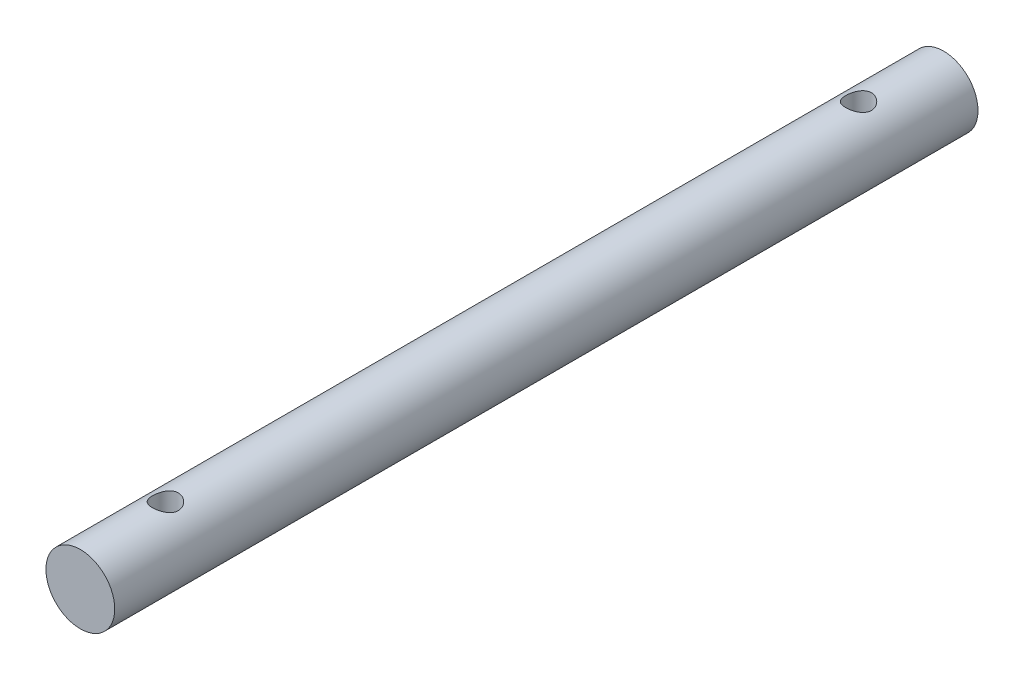
ISO-10303-21;
HEADER;
FILE_DESCRIPTION(('STEP AP214'),'2;1');
FILE_NAME('part.step','',(''),(''),'','','');
FILE_SCHEMA(('AUTOMOTIVE_DESIGN { 1 0 10303 214 1 1 1 1 }'));
ENDSEC;
DATA;
#1=APPLICATION_CONTEXT('core data for automotive mechanical design processes');
#2=APPLICATION_PROTOCOL_DEFINITION('international standard','automotive_design',2000,#1);
#3=PRODUCT_CONTEXT('',#1,'mechanical');
#4=PRODUCT('Part','Part','',(#3));
#5=PRODUCT_RELATED_PRODUCT_CATEGORY('part','',(#4));
#6=PRODUCT_DEFINITION_FORMATION('','',#4);
#7=PRODUCT_DEFINITION_CONTEXT('part definition',#1,'design');
#8=PRODUCT_DEFINITION('design','',#6,#7);
#9=PRODUCT_DEFINITION_SHAPE('','',#8);
#10=(LENGTH_UNIT() NAMED_UNIT(*) SI_UNIT(.MILLI.,.METRE.));
#11=(NAMED_UNIT(*) PLANE_ANGLE_UNIT() SI_UNIT($,.RADIAN.));
#12=(NAMED_UNIT(*) SI_UNIT($,.STERADIAN.) SOLID_ANGLE_UNIT());
#13=UNCERTAINTY_MEASURE_WITH_UNIT(LENGTH_MEASURE(1.E-05),#10,'distance_accuracy_value','');
#14=(GEOMETRIC_REPRESENTATION_CONTEXT(3) GLOBAL_UNCERTAINTY_ASSIGNED_CONTEXT((#13)) GLOBAL_UNIT_ASSIGNED_CONTEXT((#10,
#11,#12)) REPRESENTATION_CONTEXT('',''));
#15=CARTESIAN_POINT('',(0.,0.,0.));
#16=DIRECTION('',(0.,0.,1.));
#17=DIRECTION('',(1.,0.,0.));
#18=AXIS2_PLACEMENT_3D('',#15,#16,#17);
#19=CARTESIAN_POINT('',(0.,0.,50.18));
#20=DIRECTION('',(0.,0.,-1.));
#21=DIRECTION('',(-1.,0.,0.));
#22=AXIS2_PLACEMENT_3D('',#19,#20,#21);
#23=CYLINDRICAL_SURFACE('',#22,4.);
#24=CARTESIAN_POINT('',(0.,-4.,-38.79));
#25=CARTESIAN_POINT('',(0.0812350589378528,-4.00000217456151,-38.7899970976969));
#26=CARTESIAN_POINT('',(0.162450241781792,-3.99750379283184,-38.7966197602484));
#27=CARTESIAN_POINT('',(0.322453452352361,-3.98778696006928,-38.8228281952699));
#28=CARTESIAN_POINT('',(0.401241827987616,-3.98056918893993,-38.8424121004706));
#29=CARTESIAN_POINT('',(0.554060784990878,-3.96218832391545,-38.8937530017718));
#30=CARTESIAN_POINT('',(0.628100224162276,-3.9510328434944,-38.9254865168218));
#31=CARTESIAN_POINT('',(0.769799310160253,-3.92588767765353,-39.0001064130158));
#32=CARTESIAN_POINT('',(0.837457239177879,-3.91189723227548,-39.0429957855442));
#33=CARTESIAN_POINT('',(0.967346417045828,-3.88186246971217,-39.1406125310709));
#34=CARTESIAN_POINT('',(1.0292707301512,-3.86576002583566,-39.1957302622594));
#35=CARTESIAN_POINT('',(1.14324421474363,-3.83360220871327,-39.3154104346588));
#36=CARTESIAN_POINT('',(1.19529036359203,-3.81754685135033,-39.3799757560879));
#37=CARTESIAN_POINT('',(1.28998202215985,-3.78662470617731,-39.5197174675232));
#38=CARTESIAN_POINT('',(1.3321939319576,-3.77182648820818,-39.5952043665458));
#39=CARTESIAN_POINT('',(1.40318646334084,-3.74599860237433,-39.7528483541685));
#40=CARTESIAN_POINT('',(1.43197244961239,-3.73496742975881,-39.8350027631551));
#41=CARTESIAN_POINT('',(1.47408431017549,-3.71854412824136,-40.0001167402582));
#42=CARTESIAN_POINT('',(1.48799593218558,-3.71293924350838,-40.0829050384354));
#43=CARTESIAN_POINT('',(1.50179556531648,-3.70738061461215,-40.2498161579938));
#44=CARTESIAN_POINT('',(1.50168936802631,-3.70742453659305,-40.3339384138745));
#45=CARTESIAN_POINT('',(1.48790429610018,-3.71297511632055,-40.495769525213));
#46=CARTESIAN_POINT('',(1.47503808509004,-3.71815468871122,-40.5735609060442));
#47=CARTESIAN_POINT('',(1.4374416786833,-3.73284938059529,-40.7257871504053));
#48=CARTESIAN_POINT('',(1.41270969663258,-3.74236515298863,-40.8002215066139));
#49=CARTESIAN_POINT('',(1.35163748571904,-3.76485702190253,-40.9452770677282));
#50=CARTESIAN_POINT('',(1.31508648737101,-3.77789517988166,-41.0157994861213));
#51=CARTESIAN_POINT('',(1.23156073762698,-3.80594210139319,-41.149945737591));
#52=CARTESIAN_POINT('',(1.18458238728897,-3.82095154457158,-41.2135671775197));
#53=CARTESIAN_POINT('',(1.07781780766549,-3.85248038859113,-41.3366036636509));
#54=CARTESIAN_POINT('',(1.01738298716955,-3.86903347455671,-41.3954486407481));
#55=CARTESIAN_POINT('',(0.887312590819017,-3.90091728164086,-41.5023379662058));
#56=CARTESIAN_POINT('',(0.81767560349736,-3.91624781465952,-41.5503806546057));
#57=CARTESIAN_POINT('',(0.669723436992414,-3.9442639480908,-41.6349303970625));
#58=CARTESIAN_POINT('',(0.591290713844713,-3.95690498259616,-41.6712475812211));
#59=CARTESIAN_POINT('',(0.428836850524578,-3.97778718326962,-41.72998260427));
#60=CARTESIAN_POINT('',(0.344818210845764,-3.98603030341493,-41.7524066165611));
#61=CARTESIAN_POINT('',(0.178375243148663,-3.99684443228065,-41.7816227875419));
#62=CARTESIAN_POINT('',(0.0961036195622074,-3.99969369025686,-41.7891826063825));
#63=CARTESIAN_POINT('',(-0.068572475255026,-4.00025893700126,-41.7906910638999));
#64=CARTESIAN_POINT('',(-0.150976912983374,-3.99797606386863,-41.7846427203168));
#65=CARTESIAN_POINT('',(-0.31026204856186,-3.98871709772643,-41.7596899576913));
#66=CARTESIAN_POINT('',(-0.387233328007337,-3.98192470962305,-41.7412884562629));
#67=CARTESIAN_POINT('',(-0.536941754957222,-3.96451477091717,-41.6928139274527));
#68=CARTESIAN_POINT('',(-0.609678350347535,-3.9538967228203,-41.662739382052));
#69=CARTESIAN_POINT('',(-0.751247765110156,-3.92949624407681,-41.5908135875605));
#70=CARTESIAN_POINT('',(-0.819903083557796,-3.91563000209348,-41.5486422707766));
#71=CARTESIAN_POINT('',(-0.949392711726626,-3.88626671564664,-41.4540818968284));
#72=CARTESIAN_POINT('',(-1.01022412027045,-3.87076907009516,-41.4016890674548));
#73=CARTESIAN_POINT('',(-1.12603079874454,-3.8387332949099,-41.2845958778757));
#74=CARTESIAN_POINT('',(-1.18046154123568,-3.82218696503729,-41.2193578172273));
#75=CARTESIAN_POINT('',(-1.27771050031903,-3.79078815746854,-41.0803486152923));
#76=CARTESIAN_POINT('',(-1.32052767414518,-3.77593583194399,-41.0065767086115));
#77=CARTESIAN_POINT('',(-1.39337773518998,-3.74966829822463,-40.8519840132277));
#78=CARTESIAN_POINT('',(-1.42335685446918,-3.73826760328493,-40.7711352540896));
#79=CARTESIAN_POINT('',(-1.46907883466889,-3.72054032891005,-40.6049902363122));
#80=CARTESIAN_POINT('',(-1.48483050305535,-3.71421061057491,-40.5196967638019));
#81=CARTESIAN_POINT('',(-1.50086347097839,-3.70775894792573,-40.3529838404589));
#82=CARTESIAN_POINT('',(-1.50207331495837,-3.70726444523341,-40.2716673682831));
#83=CARTESIAN_POINT('',(-1.49136715641593,-3.71158412745292,-40.1100546837238));
#84=CARTESIAN_POINT('',(-1.47945239850123,-3.71639780898899,-40.0297583753284));
#85=CARTESIAN_POINT('',(-1.44355815630241,-3.73048141585433,-39.8749527732834));
#86=CARTESIAN_POINT('',(-1.41995798316524,-3.73961085376663,-39.8003416537546));
#87=CARTESIAN_POINT('',(-1.36169696779919,-3.76121548297845,-39.6560944915056));
#88=CARTESIAN_POINT('',(-1.32703332944944,-3.77369151995215,-39.5864597119299));
#89=CARTESIAN_POINT('',(-1.24552075938153,-3.80139723903965,-39.4501732103024));
#90=CARTESIAN_POINT('',(-1.1981283280301,-3.81673698440964,-39.3838692032001));
#91=CARTESIAN_POINT('',(-1.09334485729906,-3.84806246757177,-39.2598584390288));
#92=CARTESIAN_POINT('',(-1.03595064012808,-3.86404840943145,-39.2021544252132));
#93=CARTESIAN_POINT('',(-0.909080396784618,-3.89590424609881,-39.0937980441782));
#94=CARTESIAN_POINT('',(-0.839118644212988,-3.91172104900645,-39.0436962465653));
#95=CARTESIAN_POINT('',(-0.691213223200817,-3.94054514457031,-38.9559773447234));
#96=CARTESIAN_POINT('',(-0.613268934090618,-3.95355221851559,-38.9183612122636));
#97=CARTESIAN_POINT('',(-0.447999082002309,-3.9757429260668,-38.8556231709517));
#98=CARTESIAN_POINT('',(-0.360413422234206,-3.98473657158356,-38.8311129353981));
#99=CARTESIAN_POINT('',(-0.181875733606381,-3.99686242179587,-38.7983070400793));
#100=CARTESIAN_POINT('',(-0.0909254163648583,-3.99999756603967,-38.7900032485127));
#101=CARTESIAN_POINT('',(0.,-4.,-38.79));
#102=B_SPLINE_CURVE_WITH_KNOTS('',3,(#24,#25,#26,#27,#28,#29,#30,#31,#32,#33,#34,#35,#36,#37,
#38,#39,#40,#41,#42,#43,#44,#45,#46,#47,#48,#49,#50,#51,#52,#53,#54,#55,#56,#57,#58,#59,#60,#61,
#62,#63,#64,#65,#66,#67,#68,#69,#70,#71,#72,#73,#74,#75,#76,#77,#78,#79,#80,#81,#82,#83,#84,#85,
#86,#87,#88,#89,#90,#91,#92,#93,#94,#95,#96,#97,#98,#99,#100,#101),.UNSPECIFIED.,.T.,.F.,(4,2,2,
2,2,2,2,2,2,2,2,2,2,2,2,2,2,2,2,2,2,2,2,2,2,2,2,2,2,2,2,2,2,2,2,2,2,2,4),(0.,0.243369801560559,
0.486704549530462,0.729571369213572,0.972503379609492,1.22473618582716,1.47704604925622,
1.73896674501658,2.00078269352134,2.25185874416901,2.50283106079708,2.73878345119971,
2.97477138060589,3.21522408387018,3.45575990744258,3.71246153335813,3.96920257905066,
4.22991375286076,4.49050899698846,4.73725019635926,4.98393668390521,5.2211443792384,
5.45838293254454,5.702592218596,5.94689180019867,6.20536519455657,6.46386178920141,
6.72343066727204,6.98283874956507,7.22558763480253,7.46831350211259,7.70363142426534,
7.93900886656507,8.18672471884272,8.43451941997062,8.6957232965404,8.95694749805102,
9.22948515032042,9.50188601796128),.UNSPECIFIED.);
#103=CARTESIAN_POINT('',(0.,-4.,-38.79));
#104=VERTEX_POINT('',#103);
#105=EDGE_CURVE('E10',#104,#104,#102,.T.);
#106=ORIENTED_EDGE('',*,*,#105,.T.);
#107=EDGE_LOOP('',(#106));
#108=FACE_BOUND('',#107,.T.);
#109=CARTESIAN_POINT('',(0.,4.,-38.79));
#110=CARTESIAN_POINT('',(-0.0812350589378528,4.00000217456151,-38.7899970976969));
#111=CARTESIAN_POINT('',(-0.162450241781792,3.99750379283184,-38.7966197602484));
#112=CARTESIAN_POINT('',(-0.322453452352361,3.98778696006928,-38.8228281952699));
#113=CARTESIAN_POINT('',(-0.401241827987616,3.98056918893993,-38.8424121004706));
#114=CARTESIAN_POINT('',(-0.554060784990878,3.96218832391545,-38.8937530017718));
#115=CARTESIAN_POINT('',(-0.628100224162276,3.9510328434944,-38.9254865168218));
#116=CARTESIAN_POINT('',(-0.769799310160253,3.92588767765353,-39.0001064130158));
#117=CARTESIAN_POINT('',(-0.837457239177879,3.91189723227548,-39.0429957855442));
#118=CARTESIAN_POINT('',(-0.967346417045828,3.88186246971217,-39.1406125310709));
#119=CARTESIAN_POINT('',(-1.0292707301512,3.86576002583566,-39.1957302622594));
#120=CARTESIAN_POINT('',(-1.14324421474363,3.83360220871327,-39.3154104346588));
#121=CARTESIAN_POINT('',(-1.19529036359203,3.81754685135033,-39.3799757560879));
#122=CARTESIAN_POINT('',(-1.28998202215985,3.78662470617731,-39.5197174675232));
#123=CARTESIAN_POINT('',(-1.3321939319576,3.77182648820818,-39.5952043665458));
#124=CARTESIAN_POINT('',(-1.40318646334084,3.74599860237433,-39.7528483541685));
#125=CARTESIAN_POINT('',(-1.43197244961239,3.73496742975881,-39.8350027631551));
#126=CARTESIAN_POINT('',(-1.47408431017549,3.71854412824136,-40.0001167402582));
#127=CARTESIAN_POINT('',(-1.48799593218558,3.71293924350838,-40.0829050384354));
#128=CARTESIAN_POINT('',(-1.50179556531648,3.70738061461215,-40.2498161579938));
#129=CARTESIAN_POINT('',(-1.50168936802631,3.70742453659305,-40.3339384138745));
#130=CARTESIAN_POINT('',(-1.48790429610018,3.71297511632055,-40.495769525213));
#131=CARTESIAN_POINT('',(-1.47503808509004,3.71815468871122,-40.5735609060442));
#132=CARTESIAN_POINT('',(-1.4374416786833,3.73284938059529,-40.7257871504053));
#133=CARTESIAN_POINT('',(-1.41270969663258,3.74236515298863,-40.8002215066139));
#134=CARTESIAN_POINT('',(-1.35163748571904,3.76485702190253,-40.9452770677282));
#135=CARTESIAN_POINT('',(-1.31508648737101,3.77789517988166,-41.0157994861213));
#136=CARTESIAN_POINT('',(-1.23156073762698,3.80594210139319,-41.149945737591));
#137=CARTESIAN_POINT('',(-1.18458238728897,3.82095154457158,-41.2135671775197));
#138=CARTESIAN_POINT('',(-1.07781780766549,3.85248038859113,-41.3366036636509));
#139=CARTESIAN_POINT('',(-1.01738298716955,3.86903347455671,-41.3954486407481));
#140=CARTESIAN_POINT('',(-0.887312590819017,3.90091728164086,-41.5023379662058));
#141=CARTESIAN_POINT('',(-0.81767560349736,3.91624781465952,-41.5503806546057));
#142=CARTESIAN_POINT('',(-0.669723436992414,3.9442639480908,-41.6349303970625));
#143=CARTESIAN_POINT('',(-0.591290713844713,3.95690498259616,-41.6712475812211));
#144=CARTESIAN_POINT('',(-0.428836850524578,3.97778718326962,-41.72998260427));
#145=CARTESIAN_POINT('',(-0.344818210845764,3.98603030341493,-41.7524066165611));
#146=CARTESIAN_POINT('',(-0.178375243148663,3.99684443228065,-41.7816227875419));
#147=CARTESIAN_POINT('',(-0.0961036195622074,3.99969369025686,-41.7891826063825));
#148=CARTESIAN_POINT('',(0.068572475255026,4.00025893700126,-41.7906910638999));
#149=CARTESIAN_POINT('',(0.150976912983374,3.99797606386863,-41.7846427203168));
#150=CARTESIAN_POINT('',(0.31026204856186,3.98871709772643,-41.7596899576913));
#151=CARTESIAN_POINT('',(0.387233328007337,3.98192470962305,-41.7412884562629));
#152=CARTESIAN_POINT('',(0.536941754957222,3.96451477091717,-41.6928139274527));
#153=CARTESIAN_POINT('',(0.609678350347535,3.9538967228203,-41.662739382052));
#154=CARTESIAN_POINT('',(0.751247765110156,3.92949624407681,-41.5908135875605));
#155=CARTESIAN_POINT('',(0.819903083557796,3.91563000209348,-41.5486422707766));
#156=CARTESIAN_POINT('',(0.949392711726626,3.88626671564664,-41.4540818968284));
#157=CARTESIAN_POINT('',(1.01022412027045,3.87076907009516,-41.4016890674548));
#158=CARTESIAN_POINT('',(1.12603079874454,3.8387332949099,-41.2845958778757));
#159=CARTESIAN_POINT('',(1.18046154123568,3.82218696503729,-41.2193578172273));
#160=CARTESIAN_POINT('',(1.27771050031903,3.79078815746854,-41.0803486152923));
#161=CARTESIAN_POINT('',(1.32052767414518,3.77593583194399,-41.0065767086115));
#162=CARTESIAN_POINT('',(1.39337773518998,3.74966829822463,-40.8519840132277));
#163=CARTESIAN_POINT('',(1.42335685446918,3.73826760328493,-40.7711352540896));
#164=CARTESIAN_POINT('',(1.46907883466889,3.72054032891005,-40.6049902363122));
#165=CARTESIAN_POINT('',(1.48483050305535,3.71421061057491,-40.5196967638019));
#166=CARTESIAN_POINT('',(1.50086347097839,3.70775894792573,-40.3529838404589));
#167=CARTESIAN_POINT('',(1.50207331495837,3.70726444523341,-40.2716673682831));
#168=CARTESIAN_POINT('',(1.49136715641593,3.71158412745292,-40.1100546837238));
#169=CARTESIAN_POINT('',(1.47945239850123,3.71639780898899,-40.0297583753284));
#170=CARTESIAN_POINT('',(1.44355815630241,3.73048141585433,-39.8749527732834));
#171=CARTESIAN_POINT('',(1.41995798316524,3.73961085376663,-39.8003416537546));
#172=CARTESIAN_POINT('',(1.36169696779919,3.76121548297845,-39.6560944915056));
#173=CARTESIAN_POINT('',(1.32703332944944,3.77369151995215,-39.5864597119299));
#174=CARTESIAN_POINT('',(1.24552075938153,3.80139723903965,-39.4501732103024));
#175=CARTESIAN_POINT('',(1.1981283280301,3.81673698440964,-39.3838692032001));
#176=CARTESIAN_POINT('',(1.09334485729906,3.84806246757177,-39.2598584390288));
#177=CARTESIAN_POINT('',(1.03595064012808,3.86404840943145,-39.2021544252132));
#178=CARTESIAN_POINT('',(0.909080396784618,3.89590424609881,-39.0937980441782));
#179=CARTESIAN_POINT('',(0.839118644212988,3.91172104900645,-39.0436962465653));
#180=CARTESIAN_POINT('',(0.691213223200817,3.94054514457031,-38.9559773447234));
#181=CARTESIAN_POINT('',(0.613268934090618,3.95355221851559,-38.9183612122636));
#182=CARTESIAN_POINT('',(0.447999082002309,3.9757429260668,-38.8556231709517));
#183=CARTESIAN_POINT('',(0.360413422234206,3.98473657158356,-38.8311129353981));
#184=CARTESIAN_POINT('',(0.181875733606381,3.99686242179587,-38.7983070400793));
#185=CARTESIAN_POINT('',(0.0909254163648583,3.99999756603967,-38.7900032485127));
#186=CARTESIAN_POINT('',(0.,4.,-38.79));
#187=B_SPLINE_CURVE_WITH_KNOTS('',3,(#109,#110,#111,#112,#113,#114,#115,#116,#117,#118,#119,
#120,#121,#122,#123,#124,#125,#126,#127,#128,#129,#130,#131,#132,#133,#134,#135,#136,#137,#138,
#139,#140,#141,#142,#143,#144,#145,#146,#147,#148,#149,#150,#151,#152,#153,#154,#155,#156,#157,
#158,#159,#160,#161,#162,#163,#164,#165,#166,#167,#168,#169,#170,#171,#172,#173,#174,#175,#176,
#177,#178,#179,#180,#181,#182,#183,#184,#185,#186),.UNSPECIFIED.,.T.,.F.,(4,2,2,2,2,2,2,2,2,2,2,
2,2,2,2,2,2,2,2,2,2,2,2,2,2,2,2,2,2,2,2,2,2,2,2,2,2,2,4),(0.,0.243369801560559,
0.486704549530462,0.729571369213572,0.972503379609492,1.22473618582716,1.47704604925622,
1.73896674501658,2.00078269352134,2.25185874416901,2.50283106079708,2.73878345119971,
2.97477138060589,3.21522408387018,3.45575990744258,3.71246153335813,3.96920257905066,
4.22991375286076,4.49050899698846,4.73725019635926,4.98393668390521,5.2211443792384,
5.45838293254454,5.702592218596,5.94689180019867,6.20536519455657,6.46386178920141,
6.72343066727204,6.98283874956507,7.22558763480253,7.46831350211259,7.70363142426534,
7.93900886656507,8.18672471884272,8.43451941997062,8.6957232965404,8.95694749805102,
9.22948515032042,9.50188601796128),.UNSPECIFIED.);
#188=CARTESIAN_POINT('',(0.,4.,-38.79));
#189=VERTEX_POINT('',#188);
#190=EDGE_CURVE('E41',#189,#189,#187,.T.);
#191=ORIENTED_EDGE('',*,*,#190,.T.);
#192=EDGE_LOOP('',(#191));
#193=FACE_BOUND('',#192,.T.);
#194=CARTESIAN_POINT('',(0.,-4.,41.79));
#195=CARTESIAN_POINT('',(0.0812350589378532,-4.00000217456151,41.7900029023031));
#196=CARTESIAN_POINT('',(0.162450241781793,-3.99750379283184,41.7833802397516));
#197=CARTESIAN_POINT('',(0.322453452352362,-3.98778696006928,41.7571718047301));
#198=CARTESIAN_POINT('',(0.401241827987616,-3.98056918893993,41.7375878995294));
#199=CARTESIAN_POINT('',(0.55406078499088,-3.96218832391545,41.6862469982282));
#200=CARTESIAN_POINT('',(0.628100224162281,-3.9510328434944,41.6545134831782));
#201=CARTESIAN_POINT('',(0.769799310160257,-3.92588767765353,41.5798935869842));
#202=CARTESIAN_POINT('',(0.837457239177881,-3.91189723227548,41.5370042144558));
#203=CARTESIAN_POINT('',(0.967346417045828,-3.88186246971217,41.4393874689291));
#204=CARTESIAN_POINT('',(1.0292707301512,-3.86576002583566,41.3842697377406));
#205=CARTESIAN_POINT('',(1.14324421474363,-3.83360220871327,41.2645895653412));
#206=CARTESIAN_POINT('',(1.19529036359203,-3.81754685135033,41.2000242439121));
#207=CARTESIAN_POINT('',(1.28998202215985,-3.78662470617731,41.0602825324768));
#208=CARTESIAN_POINT('',(1.3321939319576,-3.77182648820818,40.9847956334542));
#209=CARTESIAN_POINT('',(1.40318646334084,-3.74599860237433,40.8271516458315));
#210=CARTESIAN_POINT('',(1.43197244961239,-3.73496742975881,40.7449972368449));
#211=CARTESIAN_POINT('',(1.47408431017549,-3.71854412824136,40.5798832597418));
#212=CARTESIAN_POINT('',(1.48799593218558,-3.71293924350838,40.4970949615646));
#213=CARTESIAN_POINT('',(1.50179556531648,-3.70738061461215,40.3301838420062));
#214=CARTESIAN_POINT('',(1.50168936802631,-3.70742453659305,40.2460615861255));
#215=CARTESIAN_POINT('',(1.48790429610018,-3.71297511632055,40.084230474787));
#216=CARTESIAN_POINT('',(1.47503808509004,-3.71815468871122,40.0064390939558));
#217=CARTESIAN_POINT('',(1.4374416786833,-3.73284938059529,39.8542128495947));
#218=CARTESIAN_POINT('',(1.41270969663258,-3.74236515298863,39.7797784933861));
#219=CARTESIAN_POINT('',(1.35163748571904,-3.76485702190253,39.6347229322718));
#220=CARTESIAN_POINT('',(1.31508648737101,-3.77789517988166,39.5642005138787));
#221=CARTESIAN_POINT('',(1.23156073762698,-3.80594210139319,39.430054262409));
#222=CARTESIAN_POINT('',(1.18458238728897,-3.82095154457158,39.3664328224803));
#223=CARTESIAN_POINT('',(1.07781780766549,-3.85248038859113,39.2433963363491));
#224=CARTESIAN_POINT('',(1.01738298716955,-3.86903347455671,39.1845513592519));
#225=CARTESIAN_POINT('',(0.887312590819017,-3.90091728164086,39.0776620337942));
#226=CARTESIAN_POINT('',(0.81767560349736,-3.91624781465952,39.0296193453943));
#227=CARTESIAN_POINT('',(0.669723436992415,-3.9442639480908,38.9450696029375));
#228=CARTESIAN_POINT('',(0.591290713844715,-3.95690498259616,38.9087524187789));
#229=CARTESIAN_POINT('',(0.42883685052458,-3.97778718326962,38.85001739573));
#230=CARTESIAN_POINT('',(0.344818210845765,-3.98603030341493,38.8275933834389));
#231=CARTESIAN_POINT('',(0.178375243148663,-3.99684443228065,38.7983772124581));
#232=CARTESIAN_POINT('',(0.0961036195622074,-3.99969369025686,38.7908173936175));
#233=CARTESIAN_POINT('',(-0.068572475255026,-4.00025893700126,38.7893089361001));
#234=CARTESIAN_POINT('',(-0.150976912983374,-3.99797606386863,38.7953572796832));
#235=CARTESIAN_POINT('',(-0.31026204856186,-3.98871709772643,38.8203100423087));
#236=CARTESIAN_POINT('',(-0.387233328007337,-3.98192470962305,38.8387115437371));
#237=CARTESIAN_POINT('',(-0.536941754957222,-3.96451477091717,38.8871860725473));
#238=CARTESIAN_POINT('',(-0.609678350347535,-3.9538967228203,38.917260617948));
#239=CARTESIAN_POINT('',(-0.751247765110156,-3.92949624407681,38.9891864124395));
#240=CARTESIAN_POINT('',(-0.819903083557796,-3.91563000209348,39.0313577292234));
#241=CARTESIAN_POINT('',(-0.949392711726626,-3.88626671564664,39.1259181031716));
#242=CARTESIAN_POINT('',(-1.01022412027045,-3.87076907009516,39.1783109325451));
#243=CARTESIAN_POINT('',(-1.12603079874454,-3.83873329490989,39.2954041221243));
#244=CARTESIAN_POINT('',(-1.18046154123569,-3.82218696503729,39.3606421827727));
#245=CARTESIAN_POINT('',(-1.27771050031903,-3.79078815746854,39.4996513847077));
#246=CARTESIAN_POINT('',(-1.32052767414519,-3.77593583194399,39.5734232913885));
#247=CARTESIAN_POINT('',(-1.39337773518998,-3.74966829822463,39.7280159867723));
#248=CARTESIAN_POINT('',(-1.42335685446918,-3.73826760328493,39.8088647459104));
#249=CARTESIAN_POINT('',(-1.46907883466889,-3.72054032891005,39.9750097636878));
#250=CARTESIAN_POINT('',(-1.48483050305535,-3.71421061057491,40.0603032361981));
#251=CARTESIAN_POINT('',(-1.50086347097839,-3.70775894792573,40.2270161595411));
#252=CARTESIAN_POINT('',(-1.50207331495837,-3.70726444523341,40.3083326317169));
#253=CARTESIAN_POINT('',(-1.49136715641593,-3.71158412745292,40.4699453162762));
#254=CARTESIAN_POINT('',(-1.47945239850123,-3.71639780898899,40.5502416246716));
#255=CARTESIAN_POINT('',(-1.44355815630241,-3.73048141585433,40.7050472267166));
#256=CARTESIAN_POINT('',(-1.41995798316524,-3.73961085376663,40.7796583462453));
#257=CARTESIAN_POINT('',(-1.36169696779919,-3.76121548297845,40.9239055084944));
#258=CARTESIAN_POINT('',(-1.32703332944944,-3.77369151995215,40.9935402880701));
#259=CARTESIAN_POINT('',(-1.24552075938153,-3.80139723903965,41.1298267896976));
#260=CARTESIAN_POINT('',(-1.1981283280301,-3.81673698440964,41.1961307967999));
#261=CARTESIAN_POINT('',(-1.09334485729906,-3.84806246757177,41.3201415609712));
#262=CARTESIAN_POINT('',(-1.03595064012808,-3.86404840943145,41.3778455747868));
#263=CARTESIAN_POINT('',(-0.909080396784618,-3.89590424609881,41.4862019558218));
#264=CARTESIAN_POINT('',(-0.839118644212988,-3.91172104900645,41.5363037534347));
#265=CARTESIAN_POINT('',(-0.691213223200817,-3.94054514457031,41.6240226552766));
#266=CARTESIAN_POINT('',(-0.613268934090618,-3.95355221851559,41.6616387877364));
#267=CARTESIAN_POINT('',(-0.447999082002309,-3.9757429260668,41.7243768290483));
#268=CARTESIAN_POINT('',(-0.360413422234206,-3.98473657158356,41.7488870646019));
#269=CARTESIAN_POINT('',(-0.181875733606381,-3.99686242179587,41.7816929599207));
#270=CARTESIAN_POINT('',(-0.0909254163648584,-3.99999756603967,41.7899967514873));
#271=CARTESIAN_POINT('',(0.,-4.,41.79));
#272=B_SPLINE_CURVE_WITH_KNOTS('',3,(#194,#195,#196,#197,#198,#199,#200,#201,#202,#203,#204,
#205,#206,#207,#208,#209,#210,#211,#212,#213,#214,#215,#216,#217,#218,#219,#220,#221,#222,#223,
#224,#225,#226,#227,#228,#229,#230,#231,#232,#233,#234,#235,#236,#237,#238,#239,#240,#241,#242,
#243,#244,#245,#246,#247,#248,#249,#250,#251,#252,#253,#254,#255,#256,#257,#258,#259,#260,#261,
#262,#263,#264,#265,#266,#267,#268,#269,#270,#271),.UNSPECIFIED.,.T.,.F.,(4,2,2,2,2,2,2,2,2,2,2,
2,2,2,2,2,2,2,2,2,2,2,2,2,2,2,2,2,2,2,2,2,2,2,2,2,2,2,4),(0.,0.24336980156056,0.486704549530462,
0.729571369213578,0.972503379609492,1.22473618582716,1.47704604925622,1.73896674501658,
2.00078269352134,2.25185874416901,2.50283106079708,2.73878345119971,2.97477138060589,
3.21522408387018,3.45575990744258,3.71246153335813,3.96920257905066,4.22991375286076,
4.49050899698846,4.73725019635926,4.98393668390521,5.2211443792384,5.45838293254454,
5.702592218596,5.94689180019868,6.20536519455658,6.46386178920141,6.72343066727204,
6.98283874956507,7.22558763480252,7.46831350211259,7.70363142426534,7.93900886656507,
8.18672471884272,8.43451941997062,8.6957232965404,8.95694749805102,9.22948515032042,
9.50188601796128),.UNSPECIFIED.);
#273=CARTESIAN_POINT('',(0.,-4.,41.79));
#274=VERTEX_POINT('',#273);
#275=EDGE_CURVE('E45',#274,#274,#272,.T.);
#276=ORIENTED_EDGE('',*,*,#275,.T.);
#277=EDGE_LOOP('',(#276));
#278=FACE_BOUND('',#277,.T.);
#279=CARTESIAN_POINT('',(0.,4.,41.79));
#280=CARTESIAN_POINT('',(-0.0812350589378532,4.00000217456151,41.7900029023031));
#281=CARTESIAN_POINT('',(-0.162450241781793,3.99750379283184,41.7833802397516));
#282=CARTESIAN_POINT('',(-0.322453452352362,3.98778696006928,41.7571718047301));
#283=CARTESIAN_POINT('',(-0.401241827987616,3.98056918893993,41.7375878995294));
#284=CARTESIAN_POINT('',(-0.55406078499088,3.96218832391545,41.6862469982282));
#285=CARTESIAN_POINT('',(-0.628100224162281,3.9510328434944,41.6545134831782));
#286=CARTESIAN_POINT('',(-0.769799310160257,3.92588767765353,41.5798935869842));
#287=CARTESIAN_POINT('',(-0.837457239177881,3.91189723227548,41.5370042144558));
#288=CARTESIAN_POINT('',(-0.967346417045828,3.88186246971217,41.4393874689291));
#289=CARTESIAN_POINT('',(-1.0292707301512,3.86576002583566,41.3842697377406));
#290=CARTESIAN_POINT('',(-1.14324421474363,3.83360220871327,41.2645895653412));
#291=CARTESIAN_POINT('',(-1.19529036359203,3.81754685135033,41.2000242439121));
#292=CARTESIAN_POINT('',(-1.28998202215985,3.78662470617731,41.0602825324768));
#293=CARTESIAN_POINT('',(-1.3321939319576,3.77182648820818,40.9847956334542));
#294=CARTESIAN_POINT('',(-1.40318646334084,3.74599860237433,40.8271516458315));
#295=CARTESIAN_POINT('',(-1.43197244961239,3.73496742975881,40.7449972368449));
#296=CARTESIAN_POINT('',(-1.47408431017549,3.71854412824136,40.5798832597418));
#297=CARTESIAN_POINT('',(-1.48799593218558,3.71293924350838,40.4970949615646));
#298=CARTESIAN_POINT('',(-1.50179556531648,3.70738061461215,40.3301838420062));
#299=CARTESIAN_POINT('',(-1.50168936802631,3.70742453659305,40.2460615861255));
#300=CARTESIAN_POINT('',(-1.48790429610018,3.71297511632055,40.084230474787));
#301=CARTESIAN_POINT('',(-1.47503808509004,3.71815468871122,40.0064390939558));
#302=CARTESIAN_POINT('',(-1.4374416786833,3.73284938059529,39.8542128495947));
#303=CARTESIAN_POINT('',(-1.41270969663258,3.74236515298863,39.7797784933861));
#304=CARTESIAN_POINT('',(-1.35163748571904,3.76485702190253,39.6347229322718));
#305=CARTESIAN_POINT('',(-1.31508648737101,3.77789517988166,39.5642005138787));
#306=CARTESIAN_POINT('',(-1.23156073762698,3.80594210139319,39.430054262409));
#307=CARTESIAN_POINT('',(-1.18458238728897,3.82095154457158,39.3664328224803));
#308=CARTESIAN_POINT('',(-1.07781780766549,3.85248038859113,39.2433963363491));
#309=CARTESIAN_POINT('',(-1.01738298716955,3.86903347455671,39.1845513592519));
#310=CARTESIAN_POINT('',(-0.887312590819017,3.90091728164086,39.0776620337942));
#311=CARTESIAN_POINT('',(-0.81767560349736,3.91624781465952,39.0296193453943));
#312=CARTESIAN_POINT('',(-0.669723436992415,3.9442639480908,38.9450696029375));
#313=CARTESIAN_POINT('',(-0.591290713844715,3.95690498259616,38.9087524187789));
#314=CARTESIAN_POINT('',(-0.42883685052458,3.97778718326962,38.85001739573));
#315=CARTESIAN_POINT('',(-0.344818210845765,3.98603030341493,38.8275933834389));
#316=CARTESIAN_POINT('',(-0.178375243148663,3.99684443228065,38.7983772124581));
#317=CARTESIAN_POINT('',(-0.0961036195622074,3.99969369025686,38.7908173936175));
#318=CARTESIAN_POINT('',(0.068572475255026,4.00025893700126,38.7893089361001));
#319=CARTESIAN_POINT('',(0.150976912983374,3.99797606386863,38.7953572796832));
#320=CARTESIAN_POINT('',(0.31026204856186,3.98871709772643,38.8203100423087));
#321=CARTESIAN_POINT('',(0.387233328007337,3.98192470962305,38.8387115437371));
#322=CARTESIAN_POINT('',(0.536941754957222,3.96451477091717,38.8871860725473));
#323=CARTESIAN_POINT('',(0.609678350347535,3.9538967228203,38.917260617948));
#324=CARTESIAN_POINT('',(0.751247765110156,3.92949624407681,38.9891864124395));
#325=CARTESIAN_POINT('',(0.819903083557796,3.91563000209348,39.0313577292234));
#326=CARTESIAN_POINT('',(0.949392711726626,3.88626671564664,39.1259181031716));
#327=CARTESIAN_POINT('',(1.01022412027045,3.87076907009516,39.1783109325451));
#328=CARTESIAN_POINT('',(1.12603079874454,3.83873329490989,39.2954041221243));
#329=CARTESIAN_POINT('',(1.18046154123569,3.82218696503729,39.3606421827727));
#330=CARTESIAN_POINT('',(1.27771050031903,3.79078815746854,39.4996513847077));
#331=CARTESIAN_POINT('',(1.32052767414519,3.77593583194399,39.5734232913885));
#332=CARTESIAN_POINT('',(1.39337773518998,3.74966829822463,39.7280159867723));
#333=CARTESIAN_POINT('',(1.42335685446918,3.73826760328493,39.8088647459104));
#334=CARTESIAN_POINT('',(1.46907883466889,3.72054032891005,39.9750097636878));
#335=CARTESIAN_POINT('',(1.48483050305535,3.71421061057491,40.0603032361981));
#336=CARTESIAN_POINT('',(1.50086347097839,3.70775894792573,40.2270161595411));
#337=CARTESIAN_POINT('',(1.50207331495837,3.70726444523341,40.3083326317169));
#338=CARTESIAN_POINT('',(1.49136715641593,3.71158412745292,40.4699453162762));
#339=CARTESIAN_POINT('',(1.47945239850123,3.71639780898899,40.5502416246716));
#340=CARTESIAN_POINT('',(1.44355815630241,3.73048141585433,40.7050472267166));
#341=CARTESIAN_POINT('',(1.41995798316524,3.73961085376663,40.7796583462453));
#342=CARTESIAN_POINT('',(1.36169696779919,3.76121548297845,40.9239055084944));
#343=CARTESIAN_POINT('',(1.32703332944944,3.77369151995215,40.9935402880701));
#344=CARTESIAN_POINT('',(1.24552075938153,3.80139723903965,41.1298267896976));
#345=CARTESIAN_POINT('',(1.1981283280301,3.81673698440964,41.1961307967999));
#346=CARTESIAN_POINT('',(1.09334485729906,3.84806246757177,41.3201415609712));
#347=CARTESIAN_POINT('',(1.03595064012808,3.86404840943145,41.3778455747868));
#348=CARTESIAN_POINT('',(0.909080396784618,3.89590424609881,41.4862019558218));
#349=CARTESIAN_POINT('',(0.839118644212988,3.91172104900645,41.5363037534347));
#350=CARTESIAN_POINT('',(0.691213223200817,3.94054514457031,41.6240226552766));
#351=CARTESIAN_POINT('',(0.613268934090618,3.95355221851559,41.6616387877364));
#352=CARTESIAN_POINT('',(0.447999082002309,3.9757429260668,41.7243768290483));
#353=CARTESIAN_POINT('',(0.360413422234206,3.98473657158356,41.7488870646019));
#354=CARTESIAN_POINT('',(0.181875733606381,3.99686242179587,41.7816929599207));
#355=CARTESIAN_POINT('',(0.0909254163648584,3.99999756603967,41.7899967514873));
#356=CARTESIAN_POINT('',(0.,4.,41.79));
#357=B_SPLINE_CURVE_WITH_KNOTS('',3,(#279,#280,#281,#282,#283,#284,#285,#286,#287,#288,#289,
#290,#291,#292,#293,#294,#295,#296,#297,#298,#299,#300,#301,#302,#303,#304,#305,#306,#307,#308,
#309,#310,#311,#312,#313,#314,#315,#316,#317,#318,#319,#320,#321,#322,#323,#324,#325,#326,#327,
#328,#329,#330,#331,#332,#333,#334,#335,#336,#337,#338,#339,#340,#341,#342,#343,#344,#345,#346,
#347,#348,#349,#350,#351,#352,#353,#354,#355,#356),.UNSPECIFIED.,.T.,.F.,(4,2,2,2,2,2,2,2,2,2,2,
2,2,2,2,2,2,2,2,2,2,2,2,2,2,2,2,2,2,2,2,2,2,2,2,2,2,2,4),(0.,0.24336980156056,0.486704549530462,
0.729571369213578,0.972503379609492,1.22473618582716,1.47704604925622,1.73896674501658,
2.00078269352134,2.25185874416901,2.50283106079708,2.73878345119971,2.97477138060589,
3.21522408387018,3.45575990744258,3.71246153335813,3.96920257905066,4.22991375286076,
4.49050899698846,4.73725019635926,4.98393668390521,5.2211443792384,5.45838293254454,
5.702592218596,5.94689180019868,6.20536519455658,6.46386178920141,6.72343066727204,
6.98283874956507,7.22558763480252,7.46831350211259,7.70363142426534,7.93900886656507,
8.18672471884272,8.43451941997062,8.6957232965404,8.95694749805102,9.22948515032042,
9.50188601796128),.UNSPECIFIED.);
#358=CARTESIAN_POINT('',(0.,4.,41.79));
#359=VERTEX_POINT('',#358);
#360=EDGE_CURVE('E49',#359,#359,#357,.T.);
#361=ORIENTED_EDGE('',*,*,#360,.T.);
#362=EDGE_LOOP('',(#361));
#363=FACE_BOUND('',#362,.T.);
#364=CARTESIAN_POINT('',(0.,0.,50.18));
#365=DIRECTION('',(0.,0.,1.));
#366=DIRECTION('',(1.,0.,0.));
#367=AXIS2_PLACEMENT_3D('',#364,#365,#366);
#368=CIRCLE('',#367,4.);
#369=CARTESIAN_POINT('',(4.,0.,50.18));
#370=VERTEX_POINT('',#369);
#371=EDGE_CURVE('E77',#370,#370,#368,.T.);
#372=ORIENTED_EDGE('',*,*,#371,.F.);
#373=EDGE_LOOP('',(#372));
#374=FACE_BOUND('',#373,.T.);
#375=CARTESIAN_POINT('',(0.,0.,-50.18));
#376=DIRECTION('',(0.,0.,1.));
#377=DIRECTION('',(1.,0.,0.));
#378=AXIS2_PLACEMENT_3D('',#375,#376,#377);
#379=CIRCLE('',#378,4.);
#380=CARTESIAN_POINT('',(4.,0.,-50.18));
#381=VERTEX_POINT('',#380);
#382=EDGE_CURVE('E78',#381,#381,#379,.T.);
#383=ORIENTED_EDGE('',*,*,#382,.T.);
#384=EDGE_LOOP('',(#383));
#385=FACE_BOUND('',#384,.T.);
#386=ADVANCED_FACE('F30',(#108,#193,#278,#363,#374,#385),#23,.T.);
#387=CARTESIAN_POINT('',(0.,0.,50.18));
#388=DIRECTION('',(0.,0.,1.));
#389=DIRECTION('',(1.,0.,0.));
#390=AXIS2_PLACEMENT_3D('',#387,#388,#389);
#391=PLANE('',#390);
#392=ORIENTED_EDGE('',*,*,#371,.T.);
#393=EDGE_LOOP('',(#392));
#394=FACE_BOUND('',#393,.T.);
#395=ADVANCED_FACE('F70',(#394),#391,.T.);
#396=CARTESIAN_POINT('',(0.,0.,-50.18));
#397=DIRECTION('',(0.,0.,1.));
#398=DIRECTION('',(1.,0.,0.));
#399=AXIS2_PLACEMENT_3D('',#396,#397,#398);
#400=PLANE('',#399);
#401=ORIENTED_EDGE('',*,*,#382,.F.);
#402=EDGE_LOOP('',(#401));
#403=FACE_BOUND('',#402,.T.);
#404=ADVANCED_FACE('F68',(#403),#400,.F.);
#405=CARTESIAN_POINT('',(0.,-4.,40.29));
#406=DIRECTION('',(0.,1.,0.));
#407=DIRECTION('',(0.,0.,1.));
#408=AXIS2_PLACEMENT_3D('',#405,#406,#407);
#409=CYLINDRICAL_SURFACE('',#408,1.5);
#410=ORIENTED_EDGE('',*,*,#360,.F.);
#411=EDGE_LOOP('',(#410));
#412=FACE_BOUND('',#411,.T.);
#413=ORIENTED_EDGE('',*,*,#275,.F.);
#414=EDGE_LOOP('',(#413));
#415=FACE_BOUND('',#414,.T.);
#416=ADVANCED_FACE('F62',(#412,#415),#409,.F.);
#417=CARTESIAN_POINT('',(0.,-4.,-40.29));
#418=DIRECTION('',(0.,1.,0.));
#419=DIRECTION('',(0.,0.,1.));
#420=AXIS2_PLACEMENT_3D('',#417,#418,#419);
#421=CYLINDRICAL_SURFACE('',#420,1.5);
#422=ORIENTED_EDGE('',*,*,#190,.F.);
#423=EDGE_LOOP('',(#422));
#424=FACE_BOUND('',#423,.T.);
#425=ORIENTED_EDGE('',*,*,#105,.F.);
#426=EDGE_LOOP('',(#425));
#427=FACE_BOUND('',#426,.T.);
#428=ADVANCED_FACE('F59',(#424,#427),#421,.F.);
#429=CLOSED_SHELL('',(#386,#395,#404,#416,#428));
#430=MANIFOLD_SOLID_BREP('B2',#429);
#431=ADVANCED_BREP_SHAPE_REPRESENTATION('',(#18,#430),#14);
#432=SHAPE_DEFINITION_REPRESENTATION(#9,#431);
ENDSEC;
END-ISO-10303-21;
